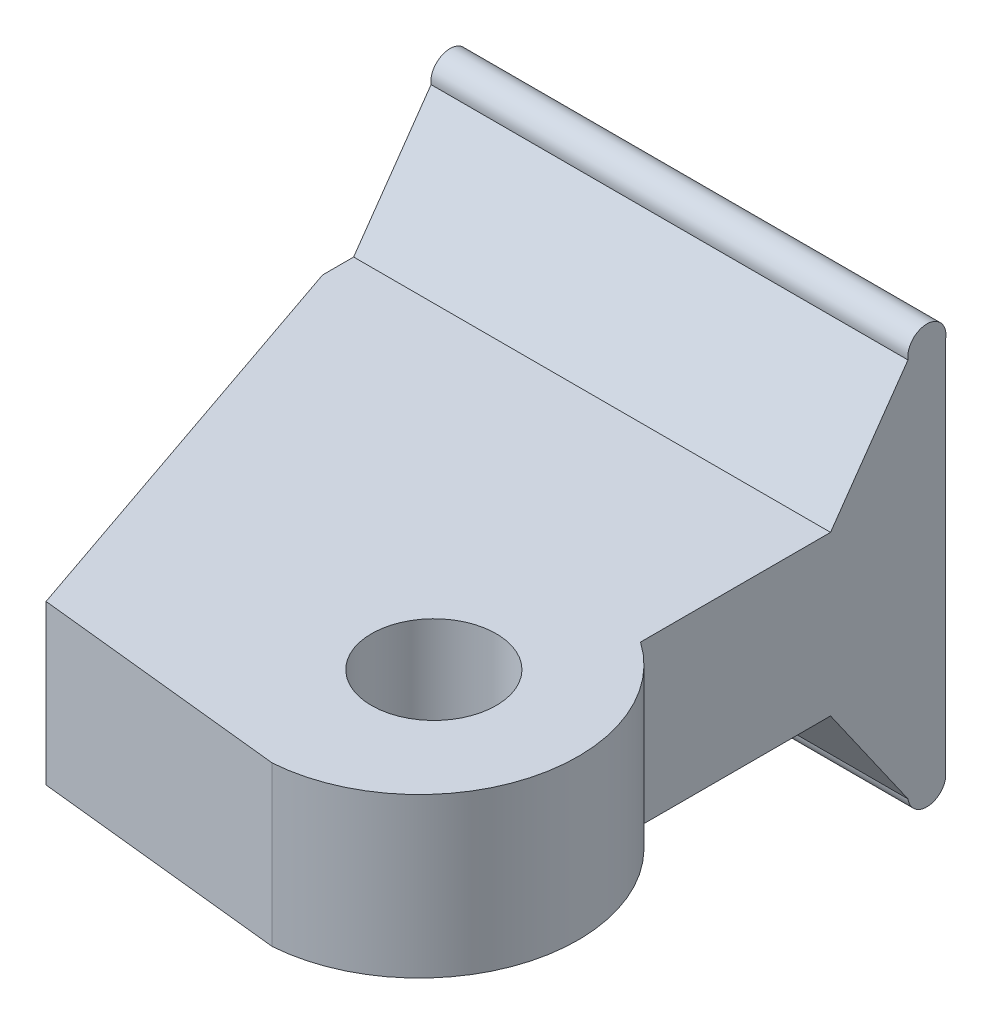
ISO-10303-21;
HEADER;
FILE_DESCRIPTION(('STEP AP214'),'2;1');
FILE_NAME('part.step','',(''),(''),'','','');
FILE_SCHEMA(('AUTOMOTIVE_DESIGN { 1 0 10303 214 1 1 1 1 }'));
ENDSEC;
DATA;
#1=APPLICATION_CONTEXT('core data for automotive mechanical design processes');
#2=APPLICATION_PROTOCOL_DEFINITION('international standard','automotive_design',2000,#1);
#3=PRODUCT_CONTEXT('',#1,'mechanical');
#4=PRODUCT('Part','Part','',(#3));
#5=PRODUCT_RELATED_PRODUCT_CATEGORY('part','',(#4));
#6=PRODUCT_DEFINITION_FORMATION('','',#4);
#7=PRODUCT_DEFINITION_CONTEXT('part definition',#1,'design');
#8=PRODUCT_DEFINITION('design','',#6,#7);
#9=PRODUCT_DEFINITION_SHAPE('','',#8);
#10=(LENGTH_UNIT() NAMED_UNIT(*) SI_UNIT(.MILLI.,.METRE.));
#11=(NAMED_UNIT(*) PLANE_ANGLE_UNIT() SI_UNIT($,.RADIAN.));
#12=(NAMED_UNIT(*) SI_UNIT($,.STERADIAN.) SOLID_ANGLE_UNIT());
#13=UNCERTAINTY_MEASURE_WITH_UNIT(LENGTH_MEASURE(1.E-05),#10,'distance_accuracy_value','');
#14=(GEOMETRIC_REPRESENTATION_CONTEXT(3) GLOBAL_UNCERTAINTY_ASSIGNED_CONTEXT((#13)) GLOBAL_UNIT_ASSIGNED_CONTEXT((#10,
#11,#12)) REPRESENTATION_CONTEXT('',''));
#15=CARTESIAN_POINT('',(0.,0.,0.));
#16=DIRECTION('',(0.,0.,1.));
#17=DIRECTION('',(1.,0.,0.));
#18=AXIS2_PLACEMENT_3D('',#15,#16,#17);
#19=CARTESIAN_POINT('',(12.7,6.35,0.));
#20=DIRECTION('',(-1.,0.,0.));
#21=DIRECTION('',(0.,0.,1.));
#22=AXIS2_PLACEMENT_3D('',#19,#20,#21);
#23=PLANE('',#22);
#24=DIRECTION('',(0.,0.,-1.));
#25=VECTOR('',#24,1.);
#26=CARTESIAN_POINT('',(12.7,0.,0.));
#27=LINE('',#26,#25);
#28=CARTESIAN_POINT('',(12.7,0.,6.35000000000004));
#29=VERTEX_POINT('',#28);
#30=CARTESIAN_POINT('',(12.7,0.,-1.24030698218164));
#31=VERTEX_POINT('',#30);
#32=EDGE_CURVE('E175',#29,#31,#27,.T.);
#33=ORIENTED_EDGE('',*,*,#32,.T.);
#34=DIRECTION('',(0.,-0.819152044288993,-0.573576436351044));
#35=VECTOR('',#34,1.);
#36=CARTESIAN_POINT('',(12.7,4.84366761439169,2.15126559399766));
#37=LINE('',#36,#35);
#38=CARTESIAN_POINT('',(12.7,-4.41709551158281,-4.33319055638417));
#39=VERTEX_POINT('',#38);
#40=EDGE_CURVE('E150',#31,#39,#37,.T.);
#41=ORIENTED_EDGE('',*,*,#40,.T.);
#42=CARTESIAN_POINT('',(12.7,-4.3097758222713,-5.08759527819208));
#43=DIRECTION('',(-1.,0.,0.));
#44=DIRECTION('',(0.,0.,1.));
#45=AXIS2_PLACEMENT_3D('',#42,#43,#44);
#46=CIRCLE('',#45,0.762);
#47=CARTESIAN_POINT('',(12.7,-4.41709551158281,-5.842));
#48=VERTEX_POINT('',#47);
#49=EDGE_CURVE('E108',#48,#39,#46,.T.);
#50=ORIENTED_EDGE('',*,*,#49,.F.);
#51=DIRECTION('',(0.,-1.,0.));
#52=VECTOR('',#51,1.);
#53=CARTESIAN_POINT('',(12.7,6.35,-5.842));
#54=LINE('',#53,#52);
#55=CARTESIAN_POINT('',(12.7,10.7670955115828,-5.842));
#56=VERTEX_POINT('',#55);
#57=EDGE_CURVE('E109',#56,#48,#54,.T.);
#58=ORIENTED_EDGE('',*,*,#57,.F.);
#59=CARTESIAN_POINT('',(12.7,10.8744152008943,-5.08759527819209));
#60=DIRECTION('',(-1.,0.,0.));
#61=DIRECTION('',(0.,0.,1.));
#62=AXIS2_PLACEMENT_3D('',#59,#60,#61);
#63=CIRCLE('',#62,0.762);
#64=CARTESIAN_POINT('',(12.7,10.7670955115828,-4.33319055638418));
#65=VERTEX_POINT('',#64);
#66=EDGE_CURVE('E138',#56,#65,#63,.F.);
#67=ORIENTED_EDGE('',*,*,#66,.T.);
#68=DIRECTION('',(0.,-0.819152044288991,0.573576436351047));
#69=VECTOR('',#68,1.);
#70=CARTESIAN_POINT('',(12.7,5.76724634066732,-0.832258476997603));
#71=LINE('',#70,#69);
#72=CARTESIAN_POINT('',(12.7,6.35,-1.24030698218164));
#73=VERTEX_POINT('',#72);
#74=EDGE_CURVE('E147',#65,#73,#71,.T.);
#75=ORIENTED_EDGE('',*,*,#74,.T.);
#76=DIRECTION('',(0.,0.,-1.));
#77=VECTOR('',#76,1.);
#78=CARTESIAN_POINT('',(12.7,6.35,0.));
#79=LINE('',#78,#77);
#80=CARTESIAN_POINT('',(12.7,6.35,6.35000000000004));
#81=VERTEX_POINT('',#80);
#82=EDGE_CURVE('E165',#81,#73,#79,.T.);
#83=ORIENTED_EDGE('',*,*,#82,.F.);
#84=DIRECTION('',(0.,-1.,0.));
#85=VECTOR('',#84,1.);
#86=CARTESIAN_POINT('',(12.7,6.35,6.35000000000004));
#87=LINE('',#86,#85);
#88=EDGE_CURVE('E126',#81,#29,#87,.T.);
#89=ORIENTED_EDGE('',*,*,#88,.T.);
#90=EDGE_LOOP('',(#33,#41,#50,#58,#67,#75,#83,#89));
#91=FACE_BOUND('',#90,.T.);
#92=ADVANCED_FACE('F36',(#91),#23,.F.);
#93=CARTESIAN_POINT('',(-6.35,12.9055102958205,0.));
#94=DIRECTION('',(1.,0.,0.));
#95=DIRECTION('',(0.,0.,-1.));
#96=AXIS2_PLACEMENT_3D('',#93,#94,#95);
#97=PLANE('',#96);
#98=DIRECTION('',(0.,0.,-1.));
#99=VECTOR('',#98,1.);
#100=CARTESIAN_POINT('',(-6.35,0.,1.98549562337107E-13));
#101=LINE('',#100,#99);
#102=CARTESIAN_POINT('',(-6.35,0.,0.));
#103=VERTEX_POINT('',#102);
#104=CARTESIAN_POINT('',(-6.35,0.,-1.24030698218164));
#105=VERTEX_POINT('',#104);
#106=EDGE_CURVE('E11',#103,#105,#101,.T.);
#107=ORIENTED_EDGE('',*,*,#106,.F.);
#108=DIRECTION('',(0.,-1.,0.));
#109=VECTOR('',#108,1.);
#110=CARTESIAN_POINT('',(-6.35,12.9055102958205,0.));
#111=LINE('',#110,#109);
#112=CARTESIAN_POINT('',(-6.35,6.35,0.));
#113=VERTEX_POINT('',#112);
#114=EDGE_CURVE('E153',#113,#103,#111,.T.);
#115=ORIENTED_EDGE('',*,*,#114,.F.);
#116=DIRECTION('',(0.,0.,-1.));
#117=VECTOR('',#116,1.);
#118=CARTESIAN_POINT('',(-6.35,6.35,0.));
#119=LINE('',#118,#117);
#120=CARTESIAN_POINT('',(-6.35,6.35,-1.24030698218164));
#121=VERTEX_POINT('',#120);
#122=EDGE_CURVE('E114',#113,#121,#119,.T.);
#123=ORIENTED_EDGE('',*,*,#122,.T.);
#124=DIRECTION('',(0.,0.819152044288991,-0.573576436351047));
#125=VECTOR('',#124,1.);
#126=CARTESIAN_POINT('',(-6.35,10.1660597740523,-3.91234080223191));
#127=LINE('',#126,#125);
#128=CARTESIAN_POINT('',(-6.35,10.7670955115828,-4.33319055638418));
#129=VERTEX_POINT('',#128);
#130=EDGE_CURVE('E116',#121,#129,#127,.T.);
#131=ORIENTED_EDGE('',*,*,#130,.T.);
#132=CARTESIAN_POINT('',(-6.35,10.8744152008943,-5.08759527819209));
#133=DIRECTION('',(-1.,0.,0.));
#134=DIRECTION('',(0.,0.,1.));
#135=AXIS2_PLACEMENT_3D('',#132,#133,#134);
#136=CIRCLE('',#135,0.762);
#137=CARTESIAN_POINT('',(-6.35,10.7670955115828,-5.842));
#138=VERTEX_POINT('',#137);
#139=EDGE_CURVE('E122',#129,#138,#136,.T.);
#140=ORIENTED_EDGE('',*,*,#139,.T.);
#141=DIRECTION('',(0.,1.,0.));
#142=VECTOR('',#141,1.);
#143=CARTESIAN_POINT('',(-6.35,0.,-5.842));
#144=LINE('',#143,#142);
#145=CARTESIAN_POINT('',(-6.35,-4.41709551158281,-5.842));
#146=VERTEX_POINT('',#145);
#147=EDGE_CURVE('E113',#146,#138,#144,.T.);
#148=ORIENTED_EDGE('',*,*,#147,.F.);
#149=CARTESIAN_POINT('',(-6.35,-4.3097758222713,-5.08759527819208));
#150=DIRECTION('',(-1.,0.,0.));
#151=DIRECTION('',(0.,0.,1.));
#152=AXIS2_PLACEMENT_3D('',#149,#150,#151);
#153=CIRCLE('',#152,0.762);
#154=CARTESIAN_POINT('',(-6.35,-4.41709551158281,-4.33319055638417));
#155=VERTEX_POINT('',#154);
#156=EDGE_CURVE('E40',#155,#146,#153,.F.);
#157=ORIENTED_EDGE('',*,*,#156,.F.);
#158=DIRECTION('',(0.,0.819152044288993,0.573576436351044));
#159=VECTOR('',#158,1.);
#160=CARTESIAN_POINT('',(-6.35,9.24248104777666,5.23134791923193));
#161=LINE('',#160,#159);
#162=EDGE_CURVE('E45',#155,#105,#161,.T.);
#163=ORIENTED_EDGE('',*,*,#162,.T.);
#164=EDGE_LOOP('',(#107,#115,#123,#131,#140,#148,#157,#163));
#165=FACE_BOUND('',#164,.T.);
#166=ADVANCED_FACE('F111',(#165),#97,.F.);
#167=CARTESIAN_POINT('',(9.06408672353238,6.35,11.5560190785289));
#168=DIRECTION('',(0.,1.,0.));
#169=DIRECTION('',(0.,0.,1.));
#170=AXIS2_PLACEMENT_3D('',#167,#168,#169);
#171=PLANE('',#170);
#172=CARTESIAN_POINT('',(9.06408672353238,6.35,11.5560190785289));
#173=DIRECTION('',(0.,1.,0.));
#174=DIRECTION('',(0.,0.,1.));
#175=AXIS2_PLACEMENT_3D('',#172,#173,#174);
#176=CIRCLE('',#175,6.35);
#177=CARTESIAN_POINT('',(9.52499999999998,6.35,17.889269346091));
#178=VERTEX_POINT('',#177);
#179=EDGE_CURVE('E163',#178,#81,#176,.T.);
#180=ORIENTED_EDGE('',*,*,#179,.T.);
#181=ORIENTED_EDGE('',*,*,#82,.T.);
#182=DIRECTION('',(-1.,0.,0.));
#183=VECTOR('',#182,1.);
#184=CARTESIAN_POINT('',(15.4140867235324,6.35,-1.24030698218164));
#185=LINE('',#184,#183);
#186=EDGE_CURVE('E141',#73,#121,#185,.T.);
#187=ORIENTED_EDGE('',*,*,#186,.T.);
#188=ORIENTED_EDGE('',*,*,#122,.F.);
#189=DIRECTION('',(0.324619143877709,0.,0.945844813607446));
#190=VECTOR('',#189,1.);
#191=CARTESIAN_POINT('',(-0.578271621854337,6.35,16.8171207859404));
#192=LINE('',#191,#190);
#193=CARTESIAN_POINT('',(-0.578271621854337,6.35,16.8171207859404));
#194=VERTEX_POINT('',#193);
#195=EDGE_CURVE('E169',#113,#194,#192,.T.);
#196=ORIENTED_EDGE('',*,*,#195,.T.);
#197=DIRECTION('',(0.994416498214008,0.,0.105526433085695));
#198=VECTOR('',#197,1.);
#199=CARTESIAN_POINT('',(9.52499999999998,6.35,17.889269346091));
#200=LINE('',#199,#198);
#201=EDGE_CURVE('E62',#194,#178,#200,.T.);
#202=ORIENTED_EDGE('',*,*,#201,.T.);
#203=EDGE_LOOP('',(#180,#181,#187,#188,#196,#202));
#204=FACE_BOUND('',#203,.T.);
#205=CARTESIAN_POINT('',(9.52499999999998,6.35,11.4299999999999));
#206=DIRECTION('',(0.,1.,0.));
#207=DIRECTION('',(0.,0.,1.));
#208=AXIS2_PLACEMENT_3D('',#205,#206,#207);
#209=CIRCLE('',#208,2.4892);
#210=CARTESIAN_POINT('',(9.52499999999998,6.35,13.9191999999999));
#211=VERTEX_POINT('',#210);
#212=EDGE_CURVE('E157',#211,#211,#209,.T.);
#213=ORIENTED_EDGE('',*,*,#212,.F.);
#214=EDGE_LOOP('',(#213));
#215=FACE_BOUND('',#214,.T.);
#216=ADVANCED_FACE('F204',(#204,#215),#171,.T.);
#217=CARTESIAN_POINT('',(9.06408672353238,0.,11.5560190785289));
#218=DIRECTION('',(0.,1.,0.));
#219=DIRECTION('',(0.,0.,1.));
#220=AXIS2_PLACEMENT_3D('',#217,#218,#219);
#221=PLANE('',#220);
#222=CARTESIAN_POINT('',(9.06408672353238,0.,11.5560190785289));
#223=DIRECTION('',(0.,1.,0.));
#224=DIRECTION('',(0.,0.,1.));
#225=AXIS2_PLACEMENT_3D('',#222,#223,#224);
#226=CIRCLE('',#225,6.35);
#227=CARTESIAN_POINT('',(9.52499999999998,0.,17.889269346091));
#228=VERTEX_POINT('',#227);
#229=EDGE_CURVE('E160',#228,#29,#226,.T.);
#230=ORIENTED_EDGE('',*,*,#229,.F.);
#231=DIRECTION('',(0.994416498214008,0.,0.105526433085695));
#232=VECTOR('',#231,1.);
#233=CARTESIAN_POINT('',(9.52499999999998,0.,17.889269346091));
#234=LINE('',#233,#232);
#235=CARTESIAN_POINT('',(-0.578271621854337,0.,16.8171207859404));
#236=VERTEX_POINT('',#235);
#237=EDGE_CURVE('E166',#236,#228,#234,.T.);
#238=ORIENTED_EDGE('',*,*,#237,.F.);
#239=DIRECTION('',(0.324619143877709,0.,0.945844813607446));
#240=VECTOR('',#239,1.);
#241=CARTESIAN_POINT('',(-0.578271621854337,0.,16.8171207859404));
#242=LINE('',#241,#240);
#243=EDGE_CURVE('E178',#103,#236,#242,.T.);
#244=ORIENTED_EDGE('',*,*,#243,.F.);
#245=ORIENTED_EDGE('',*,*,#106,.T.);
#246=DIRECTION('',(-1.,0.,0.));
#247=VECTOR('',#246,1.);
#248=CARTESIAN_POINT('',(15.4140867235324,0.,-1.24030698218164));
#249=LINE('',#248,#247);
#250=EDGE_CURVE('E98',#31,#105,#249,.T.);
#251=ORIENTED_EDGE('',*,*,#250,.F.);
#252=ORIENTED_EDGE('',*,*,#32,.F.);
#253=EDGE_LOOP('',(#230,#238,#244,#245,#251,#252));
#254=FACE_BOUND('',#253,.T.);
#255=CARTESIAN_POINT('',(9.52499999999998,0.,11.4299999999999));
#256=DIRECTION('',(0.,1.,0.));
#257=DIRECTION('',(0.,0.,1.));
#258=AXIS2_PLACEMENT_3D('',#255,#256,#257);
#259=CIRCLE('',#258,2.4892);
#260=CARTESIAN_POINT('',(9.52499999999998,0.,13.9191999999999));
#261=VERTEX_POINT('',#260);
#262=EDGE_CURVE('E156',#261,#261,#259,.T.);
#263=ORIENTED_EDGE('',*,*,#262,.T.);
#264=EDGE_LOOP('',(#263));
#265=FACE_BOUND('',#264,.T.);
#266=ADVANCED_FACE('F195',(#254,#265),#221,.F.);
#267=CARTESIAN_POINT('',(9.06408672353238,6.35,11.5560190785289));
#268=DIRECTION('',(0.,-1.,0.));
#269=DIRECTION('',(0.,0.,-1.));
#270=AXIS2_PLACEMENT_3D('',#267,#268,#269);
#271=CYLINDRICAL_SURFACE('',#270,6.35);
#272=ORIENTED_EDGE('',*,*,#229,.T.);
#273=ORIENTED_EDGE('',*,*,#88,.F.);
#274=ORIENTED_EDGE('',*,*,#179,.F.);
#275=DIRECTION('',(0.,-1.,0.));
#276=VECTOR('',#275,1.);
#277=CARTESIAN_POINT('',(9.52499999999998,6.35,17.889269346091));
#278=LINE('',#277,#276);
#279=EDGE_CURVE('E172',#178,#228,#278,.T.);
#280=ORIENTED_EDGE('',*,*,#279,.T.);
#281=EDGE_LOOP('',(#272,#273,#274,#280));
#282=FACE_BOUND('',#281,.T.);
#283=ADVANCED_FACE('F38',(#282),#271,.T.);
#284=CARTESIAN_POINT('',(-0.578271621854337,6.35,16.8171207859404));
#285=DIRECTION('',(0.945844813607445,0.,-0.324619143877709));
#286=DIRECTION('',(-0.324619143877709,0.,-0.945844813607446));
#287=AXIS2_PLACEMENT_3D('',#284,#285,#286);
#288=PLANE('',#287);
#289=ORIENTED_EDGE('',*,*,#195,.F.);
#290=ORIENTED_EDGE('',*,*,#114,.T.);
#291=ORIENTED_EDGE('',*,*,#243,.T.);
#292=DIRECTION('',(0.,-1.,0.));
#293=VECTOR('',#292,1.);
#294=CARTESIAN_POINT('',(-0.578271621854337,6.35,16.8171207859404));
#295=LINE('',#294,#293);
#296=EDGE_CURVE('E183',#194,#236,#295,.T.);
#297=ORIENTED_EDGE('',*,*,#296,.F.);
#298=EDGE_LOOP('',(#289,#290,#291,#297));
#299=FACE_BOUND('',#298,.T.);
#300=ADVANCED_FACE('F222',(#299),#288,.F.);
#301=CARTESIAN_POINT('',(9.52499999999998,6.35,17.889269346091));
#302=DIRECTION('',(0.105526433085695,0.,-0.994416498214008));
#303=DIRECTION('',(-0.994416498214008,0.,-0.105526433085695));
#304=AXIS2_PLACEMENT_3D('',#301,#302,#303);
#305=PLANE('',#304);
#306=ORIENTED_EDGE('',*,*,#237,.T.);
#307=ORIENTED_EDGE('',*,*,#279,.F.);
#308=ORIENTED_EDGE('',*,*,#201,.F.);
#309=ORIENTED_EDGE('',*,*,#296,.T.);
#310=EDGE_LOOP('',(#306,#307,#308,#309));
#311=FACE_BOUND('',#310,.T.);
#312=ADVANCED_FACE('F225',(#311),#305,.F.);
#313=CARTESIAN_POINT('',(9.52499999999998,6.35,11.4299999999999));
#314=DIRECTION('',(0.,-1.,0.));
#315=DIRECTION('',(0.,0.,-1.));
#316=AXIS2_PLACEMENT_3D('',#313,#314,#315);
#317=CYLINDRICAL_SURFACE('',#316,2.4892);
#318=ORIENTED_EDGE('',*,*,#212,.T.);
#319=EDGE_LOOP('',(#318));
#320=FACE_BOUND('',#319,.T.);
#321=ORIENTED_EDGE('',*,*,#262,.F.);
#322=EDGE_LOOP('',(#321));
#323=FACE_BOUND('',#322,.T.);
#324=ADVANCED_FACE('F227',(#320,#323),#317,.F.);
#325=CARTESIAN_POINT('',(15.4140867235324,-4.3097758222713,-5.08759527819208));
#326=DIRECTION('',(-1.,0.,0.));
#327=DIRECTION('',(0.,0.,1.));
#328=AXIS2_PLACEMENT_3D('',#325,#326,#327);
#329=CYLINDRICAL_SURFACE('',#328,0.762);
#330=ORIENTED_EDGE('',*,*,#49,.T.);
#331=DIRECTION('',(-1.,0.,0.));
#332=VECTOR('',#331,1.);
#333=CARTESIAN_POINT('',(15.4140867235324,-4.41709551158281,-4.33319055638417));
#334=LINE('',#333,#332);
#335=EDGE_CURVE('E94',#39,#155,#334,.T.);
#336=ORIENTED_EDGE('',*,*,#335,.T.);
#337=ORIENTED_EDGE('',*,*,#156,.T.);
#338=DIRECTION('',(-1.,0.,0.));
#339=VECTOR('',#338,1.);
#340=CARTESIAN_POINT('',(15.4140867235324,-4.41709551158281,-5.842));
#341=LINE('',#340,#339);
#342=EDGE_CURVE('E53',#48,#146,#341,.T.);
#343=ORIENTED_EDGE('',*,*,#342,.F.);
#344=EDGE_LOOP('',(#330,#336,#337,#343));
#345=FACE_BOUND('',#344,.T.);
#346=ADVANCED_FACE('F105',(#345),#329,.T.);
#347=CARTESIAN_POINT('',(15.4140867235324,0.582753659332655,-0.832258476997609));
#348=DIRECTION('',(0.,0.573576436351044,-0.819152044288993));
#349=DIRECTION('',(0.,0.819152044288993,0.573576436351044));
#350=AXIS2_PLACEMENT_3D('',#347,#348,#349);
#351=PLANE('',#350);
#352=ORIENTED_EDGE('',*,*,#250,.T.);
#353=ORIENTED_EDGE('',*,*,#162,.F.);
#354=ORIENTED_EDGE('',*,*,#335,.F.);
#355=ORIENTED_EDGE('',*,*,#40,.F.);
#356=EDGE_LOOP('',(#352,#353,#354,#355));
#357=FACE_BOUND('',#356,.T.);
#358=ADVANCED_FACE('F92',(#357),#351,.F.);
#359=CARTESIAN_POINT('',(15.4140867235324,1.50633238560834,2.15126559399764));
#360=DIRECTION('',(0.,-0.573576436351047,-0.819152044288991));
#361=DIRECTION('',(0.,0.819152044288991,-0.573576436351047));
#362=AXIS2_PLACEMENT_3D('',#359,#360,#361);
#363=PLANE('',#362);
#364=DIRECTION('',(-1.,0.,0.));
#365=VECTOR('',#364,1.);
#366=CARTESIAN_POINT('',(15.4140867235324,10.7670955115828,-4.33319055638418));
#367=LINE('',#366,#365);
#368=EDGE_CURVE('E134',#65,#129,#367,.T.);
#369=ORIENTED_EDGE('',*,*,#368,.T.);
#370=ORIENTED_EDGE('',*,*,#130,.F.);
#371=ORIENTED_EDGE('',*,*,#186,.F.);
#372=ORIENTED_EDGE('',*,*,#74,.F.);
#373=EDGE_LOOP('',(#369,#370,#371,#372));
#374=FACE_BOUND('',#373,.T.);
#375=ADVANCED_FACE('F211',(#374),#363,.F.);
#376=CARTESIAN_POINT('',(15.4140867235324,10.8744152008943,-5.08759527819209));
#377=DIRECTION('',(-1.,0.,0.));
#378=DIRECTION('',(0.,0.,1.));
#379=AXIS2_PLACEMENT_3D('',#376,#377,#378);
#380=CYLINDRICAL_SURFACE('',#379,0.762);
#381=DIRECTION('',(-1.,0.,0.));
#382=VECTOR('',#381,1.);
#383=CARTESIAN_POINT('',(15.4140867235324,10.7670955115828,-5.842));
#384=LINE('',#383,#382);
#385=EDGE_CURVE('E137',#56,#138,#384,.T.);
#386=ORIENTED_EDGE('',*,*,#385,.T.);
#387=ORIENTED_EDGE('',*,*,#139,.F.);
#388=ORIENTED_EDGE('',*,*,#368,.F.);
#389=ORIENTED_EDGE('',*,*,#66,.F.);
#390=EDGE_LOOP('',(#386,#387,#388,#389));
#391=FACE_BOUND('',#390,.T.);
#392=ADVANCED_FACE('F132',(#391),#380,.T.);
#393=CARTESIAN_POINT('',(15.4140867235324,0.,-5.842));
#394=DIRECTION('',(0.,0.,-1.));
#395=DIRECTION('',(0.,1.,0.));
#396=AXIS2_PLACEMENT_3D('',#393,#394,#395);
#397=PLANE('',#396);
#398=ORIENTED_EDGE('',*,*,#57,.T.);
#399=ORIENTED_EDGE('',*,*,#342,.T.);
#400=ORIENTED_EDGE('',*,*,#147,.T.);
#401=ORIENTED_EDGE('',*,*,#385,.F.);
#402=EDGE_LOOP('',(#398,#399,#400,#401));
#403=FACE_BOUND('',#402,.T.);
#404=ADVANCED_FACE('F296',(#403),#397,.T.);
#405=CLOSED_SHELL('',(#92,#166,#216,#266,#283,#300,#312,#324,#346,#358,#375,#392,#404));
#406=MANIFOLD_SOLID_BREP('B2',#405);
#407=ADVANCED_BREP_SHAPE_REPRESENTATION('',(#18,#406),#14);
#408=SHAPE_DEFINITION_REPRESENTATION(#9,#407);
ENDSEC;
END-ISO-10303-21;
